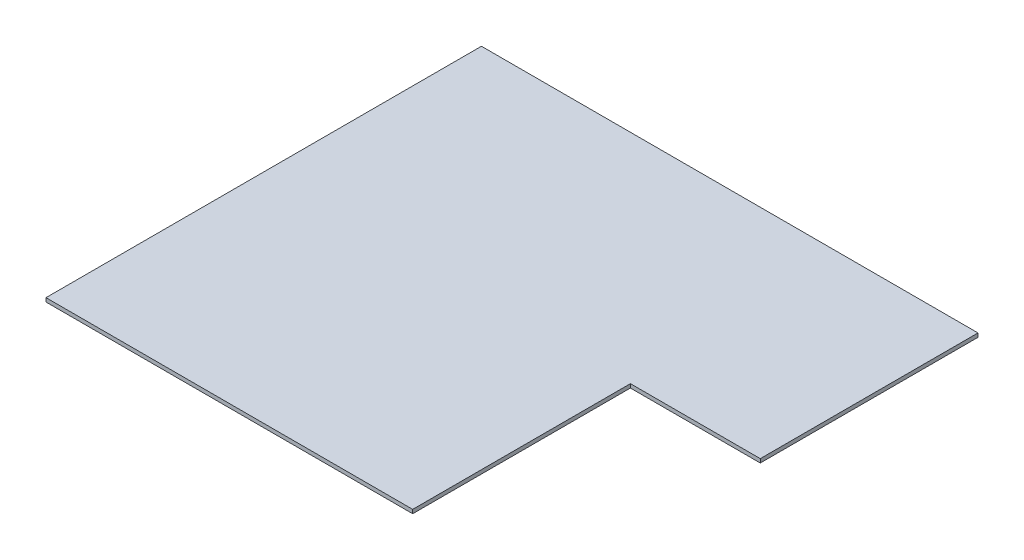
ISO-10303-21;
HEADER;
FILE_DESCRIPTION(('STEP AP214'),'2;1');
FILE_NAME('part.step','',(''),(''),'','','');
FILE_SCHEMA(('AUTOMOTIVE_DESIGN { 1 0 10303 214 1 1 1 1 }'));
ENDSEC;
DATA;
#1=APPLICATION_CONTEXT('core data for automotive mechanical design processes');
#2=APPLICATION_PROTOCOL_DEFINITION('international standard','automotive_design',2000,#1);
#3=PRODUCT_CONTEXT('',#1,'mechanical');
#4=PRODUCT('Part','Part','',(#3));
#5=PRODUCT_RELATED_PRODUCT_CATEGORY('part','',(#4));
#6=PRODUCT_DEFINITION_FORMATION('','',#4);
#7=PRODUCT_DEFINITION_CONTEXT('part definition',#1,'design');
#8=PRODUCT_DEFINITION('design','',#6,#7);
#9=PRODUCT_DEFINITION_SHAPE('','',#8);
#10=(LENGTH_UNIT() NAMED_UNIT(*) SI_UNIT(.MILLI.,.METRE.));
#11=(NAMED_UNIT(*) PLANE_ANGLE_UNIT() SI_UNIT($,.RADIAN.));
#12=(NAMED_UNIT(*) SI_UNIT($,.STERADIAN.) SOLID_ANGLE_UNIT());
#13=UNCERTAINTY_MEASURE_WITH_UNIT(LENGTH_MEASURE(1.E-05),#10,'distance_accuracy_value','');
#14=(GEOMETRIC_REPRESENTATION_CONTEXT(3) GLOBAL_UNCERTAINTY_ASSIGNED_CONTEXT((#13)) GLOBAL_UNIT_ASSIGNED_CONTEXT((#10,
#11,#12)) REPRESENTATION_CONTEXT('',''));
#15=CARTESIAN_POINT('',(0.,0.,0.));
#16=DIRECTION('',(0.,0.,1.));
#17=DIRECTION('',(1.,0.,0.));
#18=AXIS2_PLACEMENT_3D('',#15,#16,#17);
#19=CARTESIAN_POINT('',(1219.2,12.7,0.));
#20=DIRECTION('',(0.,0.,-1.));
#21=DIRECTION('',(-1.,0.,0.));
#22=AXIS2_PLACEMENT_3D('',#19,#20,#21);
#23=PLANE('',#22);
#24=DIRECTION('',(1.,0.,0.));
#25=VECTOR('',#24,1.);
#26=CARTESIAN_POINT('',(1219.2,0.,0.));
#27=LINE('',#26,#25);
#28=CARTESIAN_POINT('',(0.,0.,0.));
#29=VERTEX_POINT('',#28);
#30=CARTESIAN_POINT('',(1219.2,0.,0.));
#31=VERTEX_POINT('',#30);
#32=EDGE_CURVE('E118',#29,#31,#27,.T.);
#33=ORIENTED_EDGE('',*,*,#32,.T.);
#34=DIRECTION('',(0.,-1.,0.));
#35=VECTOR('',#34,1.);
#36=CARTESIAN_POINT('',(1219.2,12.7,0.));
#37=LINE('',#36,#35);
#38=CARTESIAN_POINT('',(1219.2,12.7,0.));
#39=VERTEX_POINT('',#38);
#40=EDGE_CURVE('E11',#39,#31,#37,.T.);
#41=ORIENTED_EDGE('',*,*,#40,.F.);
#42=DIRECTION('',(1.,0.,0.));
#43=VECTOR('',#42,1.);
#44=CARTESIAN_POINT('',(1219.2,12.7,0.));
#45=LINE('',#44,#43);
#46=CARTESIAN_POINT('',(0.,12.7,0.));
#47=VERTEX_POINT('',#46);
#48=EDGE_CURVE('E128',#47,#39,#45,.T.);
#49=ORIENTED_EDGE('',*,*,#48,.F.);
#50=DIRECTION('',(0.,-1.,0.));
#51=VECTOR('',#50,1.);
#52=CARTESIAN_POINT('',(0.,12.7,0.));
#53=LINE('',#52,#51);
#54=EDGE_CURVE('E114',#47,#29,#53,.T.);
#55=ORIENTED_EDGE('',*,*,#54,.T.);
#56=EDGE_LOOP('',(#33,#41,#49,#55));
#57=FACE_BOUND('',#56,.T.);
#58=ADVANCED_FACE('F34',(#57),#23,.F.);
#59=CARTESIAN_POINT('',(1219.2,12.7,-723.9));
#60=DIRECTION('',(-1.,0.,0.));
#61=DIRECTION('',(0.,0.,1.));
#62=AXIS2_PLACEMENT_3D('',#59,#60,#61);
#63=PLANE('',#62);
#64=DIRECTION('',(0.,0.,-1.));
#65=VECTOR('',#64,1.);
#66=CARTESIAN_POINT('',(1219.2,0.,-723.9));
#67=LINE('',#66,#65);
#68=CARTESIAN_POINT('',(1219.2,0.,-723.9));
#69=VERTEX_POINT('',#68);
#70=EDGE_CURVE('E121',#31,#69,#67,.T.);
#71=ORIENTED_EDGE('',*,*,#70,.T.);
#72=DIRECTION('',(0.,-1.,0.));
#73=VECTOR('',#72,1.);
#74=CARTESIAN_POINT('',(1219.2,12.7,-723.9));
#75=LINE('',#74,#73);
#76=CARTESIAN_POINT('',(1219.2,12.7,-723.9));
#77=VERTEX_POINT('',#76);
#78=EDGE_CURVE('E42',#77,#69,#75,.T.);
#79=ORIENTED_EDGE('',*,*,#78,.F.);
#80=DIRECTION('',(0.,0.,-1.));
#81=VECTOR('',#80,1.);
#82=CARTESIAN_POINT('',(1219.2,12.7,-723.9));
#83=LINE('',#82,#81);
#84=EDGE_CURVE('E87',#39,#77,#83,.T.);
#85=ORIENTED_EDGE('',*,*,#84,.F.);
#86=ORIENTED_EDGE('',*,*,#40,.T.);
#87=EDGE_LOOP('',(#71,#79,#85,#86));
#88=FACE_BOUND('',#87,.T.);
#89=ADVANCED_FACE('F152',(#88),#63,.F.);
#90=CARTESIAN_POINT('',(1651.,12.7,-723.9));
#91=DIRECTION('',(0.,0.,-1.));
#92=DIRECTION('',(-1.,0.,0.));
#93=AXIS2_PLACEMENT_3D('',#90,#91,#92);
#94=PLANE('',#93);
#95=DIRECTION('',(1.,0.,0.));
#96=VECTOR('',#95,1.);
#97=CARTESIAN_POINT('',(1651.,0.,-723.9));
#98=LINE('',#97,#96);
#99=CARTESIAN_POINT('',(1651.,0.,-723.9));
#100=VERTEX_POINT('',#99);
#101=EDGE_CURVE('E123',#69,#100,#98,.T.);
#102=ORIENTED_EDGE('',*,*,#101,.T.);
#103=DIRECTION('',(0.,-1.,0.));
#104=VECTOR('',#103,1.);
#105=CARTESIAN_POINT('',(1651.,12.7,-723.9));
#106=LINE('',#105,#104);
#107=CARTESIAN_POINT('',(1651.,12.7,-723.9));
#108=VERTEX_POINT('',#107);
#109=EDGE_CURVE('E109',#108,#100,#106,.T.);
#110=ORIENTED_EDGE('',*,*,#109,.F.);
#111=DIRECTION('',(1.,0.,0.));
#112=VECTOR('',#111,1.);
#113=CARTESIAN_POINT('',(1651.,12.7,-723.9));
#114=LINE('',#113,#112);
#115=EDGE_CURVE('E100',#77,#108,#114,.T.);
#116=ORIENTED_EDGE('',*,*,#115,.F.);
#117=ORIENTED_EDGE('',*,*,#78,.T.);
#118=EDGE_LOOP('',(#102,#110,#116,#117));
#119=FACE_BOUND('',#118,.T.);
#120=ADVANCED_FACE('F134',(#119),#94,.F.);
#121=CARTESIAN_POINT('',(1651.,12.7,-1447.8));
#122=DIRECTION('',(-1.,0.,0.));
#123=DIRECTION('',(0.,0.,1.));
#124=AXIS2_PLACEMENT_3D('',#121,#122,#123);
#125=PLANE('',#124);
#126=DIRECTION('',(0.,0.,-1.));
#127=VECTOR('',#126,1.);
#128=CARTESIAN_POINT('',(1651.,0.,-1447.8));
#129=LINE('',#128,#127);
#130=CARTESIAN_POINT('',(1651.,0.,-1447.8));
#131=VERTEX_POINT('',#130);
#132=EDGE_CURVE('E108',#100,#131,#129,.T.);
#133=ORIENTED_EDGE('',*,*,#132,.T.);
#134=DIRECTION('',(0.,-1.,0.));
#135=VECTOR('',#134,1.);
#136=CARTESIAN_POINT('',(1651.,12.7,-1447.8));
#137=LINE('',#136,#135);
#138=CARTESIAN_POINT('',(1651.,12.7,-1447.8));
#139=VERTEX_POINT('',#138);
#140=EDGE_CURVE('E105',#139,#131,#137,.T.);
#141=ORIENTED_EDGE('',*,*,#140,.F.);
#142=DIRECTION('',(0.,0.,-1.));
#143=VECTOR('',#142,1.);
#144=CARTESIAN_POINT('',(1651.,12.7,-1447.8));
#145=LINE('',#144,#143);
#146=EDGE_CURVE('E94',#108,#139,#145,.T.);
#147=ORIENTED_EDGE('',*,*,#146,.F.);
#148=ORIENTED_EDGE('',*,*,#109,.T.);
#149=EDGE_LOOP('',(#133,#141,#147,#148));
#150=FACE_BOUND('',#149,.T.);
#151=ADVANCED_FACE('F106',(#150),#125,.F.);
#152=CARTESIAN_POINT('',(0.,12.7,-1447.8));
#153=DIRECTION('',(0.,0.,1.));
#154=DIRECTION('',(1.,0.,0.));
#155=AXIS2_PLACEMENT_3D('',#152,#153,#154);
#156=PLANE('',#155);
#157=DIRECTION('',(-1.,0.,0.));
#158=VECTOR('',#157,1.);
#159=CARTESIAN_POINT('',(0.,0.,-1447.8));
#160=LINE('',#159,#158);
#161=CARTESIAN_POINT('',(0.,0.,-1447.8));
#162=VERTEX_POINT('',#161);
#163=EDGE_CURVE('E73',#131,#162,#160,.T.);
#164=ORIENTED_EDGE('',*,*,#163,.T.);
#165=DIRECTION('',(0.,-1.,0.));
#166=VECTOR('',#165,1.);
#167=CARTESIAN_POINT('',(0.,12.7,-1447.8));
#168=LINE('',#167,#166);
#169=CARTESIAN_POINT('',(0.,12.7,-1447.8));
#170=VERTEX_POINT('',#169);
#171=EDGE_CURVE('E110',#170,#162,#168,.T.);
#172=ORIENTED_EDGE('',*,*,#171,.F.);
#173=DIRECTION('',(-1.,0.,0.));
#174=VECTOR('',#173,1.);
#175=CARTESIAN_POINT('',(0.,12.7,-1447.8));
#176=LINE('',#175,#174);
#177=EDGE_CURVE('E98',#139,#170,#176,.T.);
#178=ORIENTED_EDGE('',*,*,#177,.F.);
#179=ORIENTED_EDGE('',*,*,#140,.T.);
#180=EDGE_LOOP('',(#164,#172,#178,#179));
#181=FACE_BOUND('',#180,.T.);
#182=ADVANCED_FACE('F112',(#181),#156,.F.);
#183=CARTESIAN_POINT('',(0.,12.7,0.));
#184=DIRECTION('',(1.,0.,0.));
#185=DIRECTION('',(0.,0.,-1.));
#186=AXIS2_PLACEMENT_3D('',#183,#184,#185);
#187=PLANE('',#186);
#188=DIRECTION('',(0.,0.,1.));
#189=VECTOR('',#188,1.);
#190=CARTESIAN_POINT('',(0.,0.,0.));
#191=LINE('',#190,#189);
#192=EDGE_CURVE('E79',#162,#29,#191,.T.);
#193=ORIENTED_EDGE('',*,*,#192,.T.);
#194=ORIENTED_EDGE('',*,*,#54,.F.);
#195=DIRECTION('',(0.,0.,1.));
#196=VECTOR('',#195,1.);
#197=CARTESIAN_POINT('',(0.,12.7,0.));
#198=LINE('',#197,#196);
#199=EDGE_CURVE('E50',#170,#47,#198,.T.);
#200=ORIENTED_EDGE('',*,*,#199,.F.);
#201=ORIENTED_EDGE('',*,*,#171,.T.);
#202=EDGE_LOOP('',(#193,#194,#200,#201));
#203=FACE_BOUND('',#202,.T.);
#204=ADVANCED_FACE('F141',(#203),#187,.F.);
#205=CARTESIAN_POINT('',(0.,12.7,0.));
#206=DIRECTION('',(0.,-1.,0.));
#207=DIRECTION('',(0.,0.,-1.));
#208=AXIS2_PLACEMENT_3D('',#205,#206,#207);
#209=PLANE('',#208);
#210=ORIENTED_EDGE('',*,*,#48,.T.);
#211=ORIENTED_EDGE('',*,*,#84,.T.);
#212=ORIENTED_EDGE('',*,*,#115,.T.);
#213=ORIENTED_EDGE('',*,*,#146,.T.);
#214=ORIENTED_EDGE('',*,*,#177,.T.);
#215=ORIENTED_EDGE('',*,*,#199,.T.);
#216=EDGE_LOOP('',(#210,#211,#212,#213,#214,#215));
#217=FACE_BOUND('',#216,.T.);
#218=ADVANCED_FACE('F96',(#217),#209,.F.);
#219=CARTESIAN_POINT('',(0.,0.,0.));
#220=DIRECTION('',(0.,-1.,0.));
#221=DIRECTION('',(0.,0.,-1.));
#222=AXIS2_PLACEMENT_3D('',#219,#220,#221);
#223=PLANE('',#222);
#224=ORIENTED_EDGE('',*,*,#32,.F.);
#225=ORIENTED_EDGE('',*,*,#192,.F.);
#226=ORIENTED_EDGE('',*,*,#163,.F.);
#227=ORIENTED_EDGE('',*,*,#132,.F.);
#228=ORIENTED_EDGE('',*,*,#101,.F.);
#229=ORIENTED_EDGE('',*,*,#70,.F.);
#230=EDGE_LOOP('',(#224,#225,#226,#227,#228,#229));
#231=FACE_BOUND('',#230,.T.);
#232=ADVANCED_FACE('F137',(#231),#223,.T.);
#233=CLOSED_SHELL('',(#58,#89,#120,#151,#182,#204,#218,#232));
#234=MANIFOLD_SOLID_BREP('B2',#233);
#235=ADVANCED_BREP_SHAPE_REPRESENTATION('',(#18,#234),#14);
#236=SHAPE_DEFINITION_REPRESENTATION(#9,#235);
ENDSEC;
END-ISO-10303-21;
